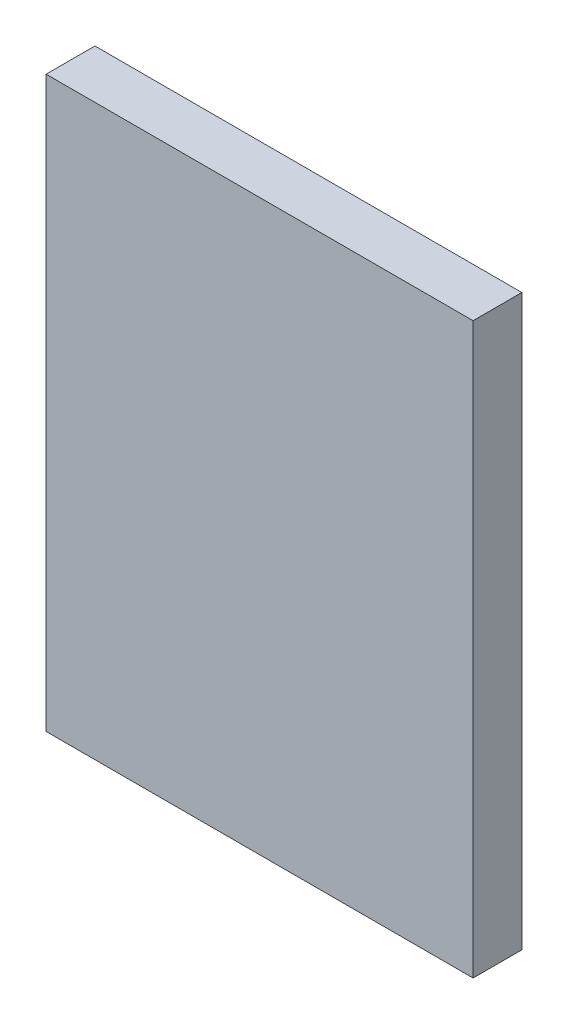
ISO-10303-21;
HEADER;
FILE_DESCRIPTION(('STEP AP214'),'2;1');
FILE_NAME('part.step','',(''),(''),'','','');
FILE_SCHEMA(('AUTOMOTIVE_DESIGN { 1 0 10303 214 1 1 1 1 }'));
ENDSEC;
DATA;
#1=APPLICATION_CONTEXT('core data for automotive mechanical design processes');
#2=APPLICATION_PROTOCOL_DEFINITION('international standard','automotive_design',2000,#1);
#3=PRODUCT_CONTEXT('',#1,'mechanical');
#4=PRODUCT('Part','Part','',(#3));
#5=PRODUCT_RELATED_PRODUCT_CATEGORY('part','',(#4));
#6=PRODUCT_DEFINITION_FORMATION('','',#4);
#7=PRODUCT_DEFINITION_CONTEXT('part definition',#1,'design');
#8=PRODUCT_DEFINITION('design','',#6,#7);
#9=PRODUCT_DEFINITION_SHAPE('','',#8);
#10=(LENGTH_UNIT() NAMED_UNIT(*) SI_UNIT(.MILLI.,.METRE.));
#11=(NAMED_UNIT(*) PLANE_ANGLE_UNIT() SI_UNIT($,.RADIAN.));
#12=(NAMED_UNIT(*) SI_UNIT($,.STERADIAN.) SOLID_ANGLE_UNIT());
#13=UNCERTAINTY_MEASURE_WITH_UNIT(LENGTH_MEASURE(1.E-05),#10,'distance_accuracy_value','');
#14=(GEOMETRIC_REPRESENTATION_CONTEXT(3) GLOBAL_UNCERTAINTY_ASSIGNED_CONTEXT((#13)) GLOBAL_UNIT_ASSIGNED_CONTEXT((#10,
#11,#12)) REPRESENTATION_CONTEXT('',''));
#15=CARTESIAN_POINT('',(0.,0.,0.));
#16=DIRECTION('',(0.,0.,1.));
#17=DIRECTION('',(1.,0.,0.));
#18=AXIS2_PLACEMENT_3D('',#15,#16,#17);
#19=CARTESIAN_POINT('',(6.828,9.413,0.76487));
#20=DIRECTION('',(0.,0.,-1.));
#21=DIRECTION('',(-1.,0.,0.));
#22=AXIS2_PLACEMENT_3D('',#19,#20,#21);
#23=PLANE('',#22);
#24=DIRECTION('',(1.,0.,0.));
#25=VECTOR('',#24,1.);
#26=CARTESIAN_POINT('',(6.678,9.613,0.76487));
#27=LINE('',#26,#25);
#28=CARTESIAN_POINT('',(6.678,9.613,0.76487));
#29=VERTEX_POINT('',#28);
#30=CARTESIAN_POINT('',(6.978,9.613,0.76487));
#31=VERTEX_POINT('',#30);
#32=EDGE_CURVE('E55',#29,#31,#27,.T.);
#33=ORIENTED_EDGE('',*,*,#32,.T.);
#34=DIRECTION('',(0.,1.,0.));
#35=VECTOR('',#34,1.);
#36=CARTESIAN_POINT('',(6.978,9.613,0.76487));
#37=LINE('',#36,#35);
#38=CARTESIAN_POINT('',(6.978,9.213,0.76487));
#39=VERTEX_POINT('',#38);
#40=EDGE_CURVE('E57',#31,#39,#37,.F.);
#41=ORIENTED_EDGE('',*,*,#40,.T.);
#42=DIRECTION('',(1.,0.,0.));
#43=VECTOR('',#42,1.);
#44=CARTESIAN_POINT('',(6.978,9.213,0.76487));
#45=LINE('',#44,#43);
#46=CARTESIAN_POINT('',(6.678,9.213,0.76487));
#47=VERTEX_POINT('',#46);
#48=EDGE_CURVE('E20',#39,#47,#45,.F.);
#49=ORIENTED_EDGE('',*,*,#48,.T.);
#50=DIRECTION('',(0.,1.,0.));
#51=VECTOR('',#50,1.);
#52=CARTESIAN_POINT('',(6.678,9.213,0.76487));
#53=LINE('',#52,#51);
#54=EDGE_CURVE('E80',#47,#29,#53,.T.);
#55=ORIENTED_EDGE('',*,*,#54,.T.);
#56=EDGE_LOOP('',(#33,#41,#49,#55));
#57=FACE_BOUND('',#56,.T.);
#58=ADVANCED_FACE('F17',(#57),#23,.T.);
#59=CARTESIAN_POINT('',(6.978,9.213,0.76487));
#60=DIRECTION('',(0.,1.,0.));
#61=DIRECTION('',(0.,0.,1.));
#62=AXIS2_PLACEMENT_3D('',#59,#60,#61);
#63=PLANE('',#62);
#64=DIRECTION('',(0.,0.,-1.));
#65=VECTOR('',#64,1.);
#66=CARTESIAN_POINT('',(6.678,9.213,0.76487));
#67=LINE('',#66,#65);
#68=CARTESIAN_POINT('',(6.678,9.213,0.79916));
#69=VERTEX_POINT('',#68);
#70=EDGE_CURVE('E68',#69,#47,#67,.T.);
#71=ORIENTED_EDGE('',*,*,#70,.T.);
#72=ORIENTED_EDGE('',*,*,#48,.F.);
#73=DIRECTION('',(0.,0.,1.));
#74=VECTOR('',#73,1.);
#75=CARTESIAN_POINT('',(6.978,9.213,0.76487));
#76=LINE('',#75,#74);
#77=CARTESIAN_POINT('',(6.978,9.213,0.79916));
#78=VERTEX_POINT('',#77);
#79=EDGE_CURVE('E63',#39,#78,#76,.T.);
#80=ORIENTED_EDGE('',*,*,#79,.T.);
#81=DIRECTION('',(1.,0.,0.));
#82=VECTOR('',#81,1.);
#83=CARTESIAN_POINT('',(6.828,9.213,0.79916));
#84=LINE('',#83,#82);
#85=EDGE_CURVE('E83',#69,#78,#84,.T.);
#86=ORIENTED_EDGE('',*,*,#85,.F.);
#87=EDGE_LOOP('',(#71,#72,#80,#86));
#88=FACE_BOUND('',#87,.T.);
#89=ADVANCED_FACE('F65',(#88),#63,.F.);
#90=CARTESIAN_POINT('',(6.978,9.613,0.76487));
#91=DIRECTION('',(-1.,0.,0.));
#92=DIRECTION('',(0.,0.,1.));
#93=AXIS2_PLACEMENT_3D('',#90,#91,#92);
#94=PLANE('',#93);
#95=ORIENTED_EDGE('',*,*,#79,.F.);
#96=ORIENTED_EDGE('',*,*,#40,.F.);
#97=DIRECTION('',(0.,0.,-1.));
#98=VECTOR('',#97,1.);
#99=CARTESIAN_POINT('',(6.978,9.613,0.76487));
#100=LINE('',#99,#98);
#101=CARTESIAN_POINT('',(6.978,9.613,0.79916));
#102=VERTEX_POINT('',#101);
#103=EDGE_CURVE('E75',#31,#102,#100,.F.);
#104=ORIENTED_EDGE('',*,*,#103,.T.);
#105=DIRECTION('',(0.,-1.,0.));
#106=VECTOR('',#105,1.);
#107=CARTESIAN_POINT('',(6.978,9.413,0.79916));
#108=LINE('',#107,#106);
#109=EDGE_CURVE('E72',#78,#102,#108,.F.);
#110=ORIENTED_EDGE('',*,*,#109,.F.);
#111=EDGE_LOOP('',(#95,#96,#104,#110));
#112=FACE_BOUND('',#111,.T.);
#113=ADVANCED_FACE('F70',(#112),#94,.F.);
#114=CARTESIAN_POINT('',(6.678,9.613,0.76487));
#115=DIRECTION('',(0.,-1.,0.));
#116=DIRECTION('',(0.,0.,-1.));
#117=AXIS2_PLACEMENT_3D('',#114,#115,#116);
#118=PLANE('',#117);
#119=ORIENTED_EDGE('',*,*,#103,.F.);
#120=ORIENTED_EDGE('',*,*,#32,.F.);
#121=DIRECTION('',(0.,0.,-1.));
#122=VECTOR('',#121,1.);
#123=CARTESIAN_POINT('',(6.678,9.613,0.76487));
#124=LINE('',#123,#122);
#125=CARTESIAN_POINT('',(6.678,9.613,0.79916));
#126=VERTEX_POINT('',#125);
#127=EDGE_CURVE('E35',#29,#126,#124,.F.);
#128=ORIENTED_EDGE('',*,*,#127,.T.);
#129=DIRECTION('',(1.,0.,0.));
#130=VECTOR('',#129,1.);
#131=CARTESIAN_POINT('',(6.828,9.613,0.79916));
#132=LINE('',#131,#130);
#133=EDGE_CURVE('E26',#102,#126,#132,.F.);
#134=ORIENTED_EDGE('',*,*,#133,.F.);
#135=EDGE_LOOP('',(#119,#120,#128,#134));
#136=FACE_BOUND('',#135,.T.);
#137=ADVANCED_FACE('F89',(#136),#118,.F.);
#138=CARTESIAN_POINT('',(6.678,9.213,0.76487));
#139=DIRECTION('',(1.,0.,0.));
#140=DIRECTION('',(0.,0.,-1.));
#141=AXIS2_PLACEMENT_3D('',#138,#139,#140);
#142=PLANE('',#141);
#143=ORIENTED_EDGE('',*,*,#127,.F.);
#144=ORIENTED_EDGE('',*,*,#54,.F.);
#145=ORIENTED_EDGE('',*,*,#70,.F.);
#146=DIRECTION('',(0.,-1.,0.));
#147=VECTOR('',#146,1.);
#148=CARTESIAN_POINT('',(6.678,9.413,0.79916));
#149=LINE('',#148,#147);
#150=EDGE_CURVE('E11',#126,#69,#149,.T.);
#151=ORIENTED_EDGE('',*,*,#150,.F.);
#152=EDGE_LOOP('',(#143,#144,#145,#151));
#153=FACE_BOUND('',#152,.T.);
#154=ADVANCED_FACE('F91',(#153),#142,.F.);
#155=CARTESIAN_POINT('',(6.828,9.413,0.79916));
#156=DIRECTION('',(0.,0.,1.));
#157=DIRECTION('',(0.,-1.,0.));
#158=AXIS2_PLACEMENT_3D('',#155,#156,#157);
#159=PLANE('',#158);
#160=ORIENTED_EDGE('',*,*,#133,.T.);
#161=ORIENTED_EDGE('',*,*,#150,.T.);
#162=ORIENTED_EDGE('',*,*,#85,.T.);
#163=ORIENTED_EDGE('',*,*,#109,.T.);
#164=EDGE_LOOP('',(#160,#161,#162,#163));
#165=FACE_BOUND('',#164,.T.);
#166=ADVANCED_FACE('F88',(#165),#159,.T.);
#167=CLOSED_SHELL('',(#58,#89,#113,#137,#154,#166));
#168=MANIFOLD_SOLID_BREP('B1',#167);
#169=ADVANCED_BREP_SHAPE_REPRESENTATION('',(#18,#168),#14);
#170=SHAPE_DEFINITION_REPRESENTATION(#9,#169);
ENDSEC;
END-ISO-10303-21;
